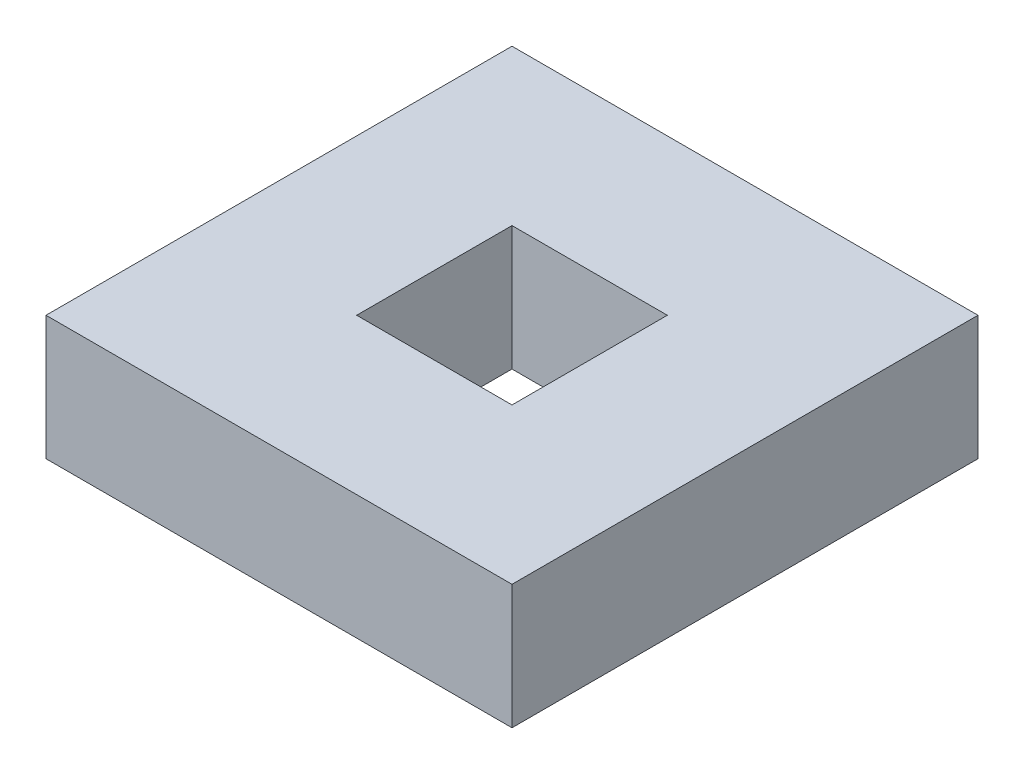
ISO-10303-21;
HEADER;
FILE_DESCRIPTION(('STEP AP214'),'2;1');
FILE_NAME('part.step','',(''),(''),'','','');
FILE_SCHEMA(('AUTOMOTIVE_DESIGN { 1 0 10303 214 1 1 1 1 }'));
ENDSEC;
DATA;
#1=APPLICATION_CONTEXT('core data for automotive mechanical design processes');
#2=APPLICATION_PROTOCOL_DEFINITION('international standard','automotive_design',2000,#1);
#3=PRODUCT_CONTEXT('',#1,'mechanical');
#4=PRODUCT('Part','Part','',(#3));
#5=PRODUCT_RELATED_PRODUCT_CATEGORY('part','',(#4));
#6=PRODUCT_DEFINITION_FORMATION('','',#4);
#7=PRODUCT_DEFINITION_CONTEXT('part definition',#1,'design');
#8=PRODUCT_DEFINITION('design','',#6,#7);
#9=PRODUCT_DEFINITION_SHAPE('','',#8);
#10=(LENGTH_UNIT() NAMED_UNIT(*) SI_UNIT(.MILLI.,.METRE.));
#11=(NAMED_UNIT(*) PLANE_ANGLE_UNIT() SI_UNIT($,.RADIAN.));
#12=(NAMED_UNIT(*) SI_UNIT($,.STERADIAN.) SOLID_ANGLE_UNIT());
#13=UNCERTAINTY_MEASURE_WITH_UNIT(LENGTH_MEASURE(1.E-05),#10,'distance_accuracy_value','');
#14=(GEOMETRIC_REPRESENTATION_CONTEXT(3) GLOBAL_UNCERTAINTY_ASSIGNED_CONTEXT((#13)) GLOBAL_UNIT_ASSIGNED_CONTEXT((#10,
#11,#12)) REPRESENTATION_CONTEXT('',''));
#15=CARTESIAN_POINT('',(0.,0.,0.));
#16=DIRECTION('',(0.,0.,1.));
#17=DIRECTION('',(1.,0.,0.));
#18=AXIS2_PLACEMENT_3D('',#15,#16,#17);
#19=CARTESIAN_POINT('',(0.,0.8,-3.));
#20=DIRECTION('',(1.,0.,0.));
#21=DIRECTION('',(0.,0.,-1.));
#22=AXIS2_PLACEMENT_3D('',#19,#20,#21);
#23=PLANE('',#22);
#24=DIRECTION('',(0.,0.,1.));
#25=VECTOR('',#24,1.);
#26=CARTESIAN_POINT('',(0.,0.,-3.));
#27=LINE('',#26,#25);
#28=CARTESIAN_POINT('',(0.,0.,-3.));
#29=VERTEX_POINT('',#28);
#30=CARTESIAN_POINT('',(0.,0.,0.));
#31=VERTEX_POINT('',#30);
#32=EDGE_CURVE('E139',#29,#31,#27,.T.);
#33=ORIENTED_EDGE('',*,*,#32,.T.);
#34=DIRECTION('',(0.,-1.,0.));
#35=VECTOR('',#34,1.);
#36=CARTESIAN_POINT('',(0.,0.8,0.));
#37=LINE('',#36,#35);
#38=CARTESIAN_POINT('',(0.,0.8,0.));
#39=VERTEX_POINT('',#38);
#40=EDGE_CURVE('E181',#39,#31,#37,.T.);
#41=ORIENTED_EDGE('',*,*,#40,.F.);
#42=DIRECTION('',(0.,0.,1.));
#43=VECTOR('',#42,1.);
#44=CARTESIAN_POINT('',(0.,0.8,-3.));
#45=LINE('',#44,#43);
#46=CARTESIAN_POINT('',(0.,0.8,-3.));
#47=VERTEX_POINT('',#46);
#48=EDGE_CURVE('E144',#47,#39,#45,.T.);
#49=ORIENTED_EDGE('',*,*,#48,.F.);
#50=DIRECTION('',(0.,-1.,0.));
#51=VECTOR('',#50,1.);
#52=CARTESIAN_POINT('',(0.,0.8,-3.));
#53=LINE('',#52,#51);
#54=EDGE_CURVE('E158',#47,#29,#53,.T.);
#55=ORIENTED_EDGE('',*,*,#54,.T.);
#56=EDGE_LOOP('',(#33,#41,#49,#55));
#57=FACE_BOUND('',#56,.T.);
#58=ADVANCED_FACE('F43',(#57),#23,.F.);
#59=CARTESIAN_POINT('',(0.,0.8,0.));
#60=DIRECTION('',(0.,0.,-1.));
#61=DIRECTION('',(-1.,0.,0.));
#62=AXIS2_PLACEMENT_3D('',#59,#60,#61);
#63=PLANE('',#62);
#64=DIRECTION('',(1.,0.,0.));
#65=VECTOR('',#64,1.);
#66=CARTESIAN_POINT('',(0.,0.,0.));
#67=LINE('',#66,#65);
#68=CARTESIAN_POINT('',(3.,0.,0.));
#69=VERTEX_POINT('',#68);
#70=EDGE_CURVE('E162',#31,#69,#67,.T.);
#71=ORIENTED_EDGE('',*,*,#70,.T.);
#72=DIRECTION('',(0.,-1.,0.));
#73=VECTOR('',#72,1.);
#74=CARTESIAN_POINT('',(3.,0.8,0.));
#75=LINE('',#74,#73);
#76=CARTESIAN_POINT('',(3.,0.8,0.));
#77=VERTEX_POINT('',#76);
#78=EDGE_CURVE('E177',#77,#69,#75,.T.);
#79=ORIENTED_EDGE('',*,*,#78,.F.);
#80=DIRECTION('',(1.,0.,0.));
#81=VECTOR('',#80,1.);
#82=CARTESIAN_POINT('',(0.,0.8,0.));
#83=LINE('',#82,#81);
#84=EDGE_CURVE('E148',#39,#77,#83,.T.);
#85=ORIENTED_EDGE('',*,*,#84,.F.);
#86=ORIENTED_EDGE('',*,*,#40,.T.);
#87=EDGE_LOOP('',(#71,#79,#85,#86));
#88=FACE_BOUND('',#87,.T.);
#89=ADVANCED_FACE('F209',(#88),#63,.F.);
#90=CARTESIAN_POINT('',(3.,0.8,-3.));
#91=DIRECTION('',(-1.,0.,0.));
#92=DIRECTION('',(0.,0.,1.));
#93=AXIS2_PLACEMENT_3D('',#90,#91,#92);
#94=PLANE('',#93);
#95=DIRECTION('',(0.,0.,-1.));
#96=VECTOR('',#95,1.);
#97=CARTESIAN_POINT('',(3.,0.,-3.));
#98=LINE('',#97,#96);
#99=CARTESIAN_POINT('',(3.,0.,-3.));
#100=VERTEX_POINT('',#99);
#101=EDGE_CURVE('E165',#69,#100,#98,.T.);
#102=ORIENTED_EDGE('',*,*,#101,.T.);
#103=DIRECTION('',(0.,-1.,0.));
#104=VECTOR('',#103,1.);
#105=CARTESIAN_POINT('',(3.,0.8,-3.));
#106=LINE('',#105,#104);
#107=CARTESIAN_POINT('',(3.,0.8,-3.));
#108=VERTEX_POINT('',#107);
#109=EDGE_CURVE('E173',#108,#100,#106,.T.);
#110=ORIENTED_EDGE('',*,*,#109,.F.);
#111=DIRECTION('',(0.,0.,-1.));
#112=VECTOR('',#111,1.);
#113=CARTESIAN_POINT('',(3.,0.8,-3.));
#114=LINE('',#113,#112);
#115=EDGE_CURVE('E152',#77,#108,#114,.T.);
#116=ORIENTED_EDGE('',*,*,#115,.F.);
#117=ORIENTED_EDGE('',*,*,#78,.T.);
#118=EDGE_LOOP('',(#102,#110,#116,#117));
#119=FACE_BOUND('',#118,.T.);
#120=ADVANCED_FACE('F214',(#119),#94,.F.);
#121=CARTESIAN_POINT('',(0.,0.8,-3.));
#122=DIRECTION('',(0.,0.,1.));
#123=DIRECTION('',(1.,0.,0.));
#124=AXIS2_PLACEMENT_3D('',#121,#122,#123);
#125=PLANE('',#124);
#126=DIRECTION('',(-1.,0.,0.));
#127=VECTOR('',#126,1.);
#128=CARTESIAN_POINT('',(0.,0.,-3.));
#129=LINE('',#128,#127);
#130=EDGE_CURVE('E149',#100,#29,#129,.T.);
#131=ORIENTED_EDGE('',*,*,#130,.T.);
#132=ORIENTED_EDGE('',*,*,#54,.F.);
#133=DIRECTION('',(-1.,0.,0.));
#134=VECTOR('',#133,1.);
#135=CARTESIAN_POINT('',(0.,0.8,-3.));
#136=LINE('',#135,#134);
#137=EDGE_CURVE('E155',#108,#47,#136,.T.);
#138=ORIENTED_EDGE('',*,*,#137,.F.);
#139=ORIENTED_EDGE('',*,*,#109,.T.);
#140=EDGE_LOOP('',(#131,#132,#138,#139));
#141=FACE_BOUND('',#140,.T.);
#142=ADVANCED_FACE('F227',(#141),#125,.F.);
#143=CARTESIAN_POINT('',(0.,0.8,0.));
#144=DIRECTION('',(0.,1.,0.));
#145=DIRECTION('',(0.,0.,1.));
#146=AXIS2_PLACEMENT_3D('',#143,#144,#145);
#147=PLANE('',#146);
#148=DIRECTION('',(0.,0.,1.));
#149=VECTOR('',#148,1.);
#150=CARTESIAN_POINT('',(1.,0.8,-2.));
#151=LINE('',#150,#149);
#152=CARTESIAN_POINT('',(1.,0.8,-2.));
#153=VERTEX_POINT('',#152);
#154=CARTESIAN_POINT('',(1.,0.8,-1.));
#155=VERTEX_POINT('',#154);
#156=EDGE_CURVE('E58',#153,#155,#151,.T.);
#157=ORIENTED_EDGE('',*,*,#156,.F.);
#158=DIRECTION('',(-1.,0.,0.));
#159=VECTOR('',#158,1.);
#160=CARTESIAN_POINT('',(1.,0.8,-2.));
#161=LINE('',#160,#159);
#162=CARTESIAN_POINT('',(2.,0.8,-2.));
#163=VERTEX_POINT('',#162);
#164=EDGE_CURVE('E129',#163,#153,#161,.T.);
#165=ORIENTED_EDGE('',*,*,#164,.F.);
#166=DIRECTION('',(0.,0.,-1.));
#167=VECTOR('',#166,1.);
#168=CARTESIAN_POINT('',(2.,0.8,-2.));
#169=LINE('',#168,#167);
#170=CARTESIAN_POINT('',(2.,0.8,-1.));
#171=VERTEX_POINT('',#170);
#172=EDGE_CURVE('E111',#171,#163,#169,.T.);
#173=ORIENTED_EDGE('',*,*,#172,.F.);
#174=DIRECTION('',(1.,0.,0.));
#175=VECTOR('',#174,1.);
#176=CARTESIAN_POINT('',(1.,0.8,-1.));
#177=LINE('',#176,#175);
#178=EDGE_CURVE('E121',#155,#171,#177,.T.);
#179=ORIENTED_EDGE('',*,*,#178,.F.);
#180=EDGE_LOOP('',(#157,#165,#173,#179));
#181=FACE_BOUND('',#180,.T.);
#182=ORIENTED_EDGE('',*,*,#48,.T.);
#183=ORIENTED_EDGE('',*,*,#84,.T.);
#184=ORIENTED_EDGE('',*,*,#115,.T.);
#185=ORIENTED_EDGE('',*,*,#137,.T.);
#186=EDGE_LOOP('',(#182,#183,#184,#185));
#187=FACE_BOUND('',#186,.T.);
#188=ADVANCED_FACE('F126',(#181,#187),#147,.T.);
#189=CARTESIAN_POINT('',(0.,0.,0.));
#190=DIRECTION('',(0.,1.,0.));
#191=DIRECTION('',(0.,0.,1.));
#192=AXIS2_PLACEMENT_3D('',#189,#190,#191);
#193=PLANE('',#192);
#194=DIRECTION('',(-1.,0.,0.));
#195=VECTOR('',#194,1.);
#196=CARTESIAN_POINT('',(0.,0.,-2.));
#197=LINE('',#196,#195);
#198=CARTESIAN_POINT('',(2.,0.,-2.));
#199=VERTEX_POINT('',#198);
#200=CARTESIAN_POINT('',(1.,0.,-2.));
#201=VERTEX_POINT('',#200);
#202=EDGE_CURVE('E51',#199,#201,#197,.T.);
#203=ORIENTED_EDGE('',*,*,#202,.T.);
#204=DIRECTION('',(0.,0.,1.));
#205=VECTOR('',#204,1.);
#206=CARTESIAN_POINT('',(1.,0.,0.));
#207=LINE('',#206,#205);
#208=CARTESIAN_POINT('',(1.,0.,-1.));
#209=VERTEX_POINT('',#208);
#210=EDGE_CURVE('E11',#201,#209,#207,.T.);
#211=ORIENTED_EDGE('',*,*,#210,.T.);
#212=DIRECTION('',(1.,0.,0.));
#213=VECTOR('',#212,1.);
#214=CARTESIAN_POINT('',(0.,0.,-1.));
#215=LINE('',#214,#213);
#216=CARTESIAN_POINT('',(2.,0.,-1.));
#217=VERTEX_POINT('',#216);
#218=EDGE_CURVE('E185',#209,#217,#215,.T.);
#219=ORIENTED_EDGE('',*,*,#218,.T.);
#220=DIRECTION('',(0.,0.,-1.));
#221=VECTOR('',#220,1.);
#222=CARTESIAN_POINT('',(2.,0.,0.));
#223=LINE('',#222,#221);
#224=EDGE_CURVE('E114',#217,#199,#223,.T.);
#225=ORIENTED_EDGE('',*,*,#224,.T.);
#226=EDGE_LOOP('',(#203,#211,#219,#225));
#227=FACE_BOUND('',#226,.T.);
#228=ORIENTED_EDGE('',*,*,#32,.F.);
#229=ORIENTED_EDGE('',*,*,#130,.F.);
#230=ORIENTED_EDGE('',*,*,#101,.F.);
#231=ORIENTED_EDGE('',*,*,#70,.F.);
#232=EDGE_LOOP('',(#228,#229,#230,#231));
#233=FACE_BOUND('',#232,.T.);
#234=ADVANCED_FACE('F192',(#227,#233),#193,.F.);
#235=CARTESIAN_POINT('',(1.,-0.8,-2.));
#236=DIRECTION('',(-1.,0.,0.));
#237=DIRECTION('',(0.,0.,1.));
#238=AXIS2_PLACEMENT_3D('',#235,#236,#237);
#239=PLANE('',#238);
#240=DIRECTION('',(0.,1.,0.));
#241=VECTOR('',#240,1.);
#242=CARTESIAN_POINT('',(1.,-0.8,-2.));
#243=LINE('',#242,#241);
#244=EDGE_CURVE('E136',#201,#153,#243,.T.);
#245=ORIENTED_EDGE('',*,*,#244,.T.);
#246=ORIENTED_EDGE('',*,*,#156,.T.);
#247=DIRECTION('',(0.,1.,0.));
#248=VECTOR('',#247,1.);
#249=CARTESIAN_POINT('',(1.,-0.8,-1.));
#250=LINE('',#249,#248);
#251=EDGE_CURVE('E118',#209,#155,#250,.T.);
#252=ORIENTED_EDGE('',*,*,#251,.F.);
#253=ORIENTED_EDGE('',*,*,#210,.F.);
#254=EDGE_LOOP('',(#245,#246,#252,#253));
#255=FACE_BOUND('',#254,.T.);
#256=ADVANCED_FACE('F197',(#255),#239,.F.);
#257=CARTESIAN_POINT('',(1.,-0.8,-2.));
#258=DIRECTION('',(0.,0.,-1.));
#259=DIRECTION('',(-1.,0.,0.));
#260=AXIS2_PLACEMENT_3D('',#257,#258,#259);
#261=PLANE('',#260);
#262=DIRECTION('',(0.,1.,0.));
#263=VECTOR('',#262,1.);
#264=CARTESIAN_POINT('',(2.,-0.8,-2.));
#265=LINE('',#264,#263);
#266=EDGE_CURVE('E117',#199,#163,#265,.T.);
#267=ORIENTED_EDGE('',*,*,#266,.T.);
#268=ORIENTED_EDGE('',*,*,#164,.T.);
#269=ORIENTED_EDGE('',*,*,#244,.F.);
#270=ORIENTED_EDGE('',*,*,#202,.F.);
#271=EDGE_LOOP('',(#267,#268,#269,#270));
#272=FACE_BOUND('',#271,.T.);
#273=ADVANCED_FACE('F196',(#272),#261,.F.);
#274=CARTESIAN_POINT('',(2.,-0.8,-2.));
#275=DIRECTION('',(1.,0.,0.));
#276=DIRECTION('',(0.,0.,-1.));
#277=AXIS2_PLACEMENT_3D('',#274,#275,#276);
#278=PLANE('',#277);
#279=DIRECTION('',(0.,1.,0.));
#280=VECTOR('',#279,1.);
#281=CARTESIAN_POINT('',(2.,-0.8,-1.));
#282=LINE('',#281,#280);
#283=EDGE_CURVE('E66',#217,#171,#282,.T.);
#284=ORIENTED_EDGE('',*,*,#283,.T.);
#285=ORIENTED_EDGE('',*,*,#172,.T.);
#286=ORIENTED_EDGE('',*,*,#266,.F.);
#287=ORIENTED_EDGE('',*,*,#224,.F.);
#288=EDGE_LOOP('',(#284,#285,#286,#287));
#289=FACE_BOUND('',#288,.T.);
#290=ADVANCED_FACE('F108',(#289),#278,.F.);
#291=CARTESIAN_POINT('',(1.,-0.8,-1.));
#292=DIRECTION('',(0.,0.,1.));
#293=DIRECTION('',(1.,0.,0.));
#294=AXIS2_PLACEMENT_3D('',#291,#292,#293);
#295=PLANE('',#294);
#296=ORIENTED_EDGE('',*,*,#251,.T.);
#297=ORIENTED_EDGE('',*,*,#178,.T.);
#298=ORIENTED_EDGE('',*,*,#283,.F.);
#299=ORIENTED_EDGE('',*,*,#218,.F.);
#300=EDGE_LOOP('',(#296,#297,#298,#299));
#301=FACE_BOUND('',#300,.T.);
#302=ADVANCED_FACE('F122',(#301),#295,.F.);
#303=CLOSED_SHELL('',(#58,#89,#120,#142,#188,#234,#256,#273,#290,#302));
#304=MANIFOLD_SOLID_BREP('B2',#303);
#305=ADVANCED_BREP_SHAPE_REPRESENTATION('',(#18,#304),#14);
#306=SHAPE_DEFINITION_REPRESENTATION(#9,#305);
ENDSEC;
END-ISO-10303-21;
